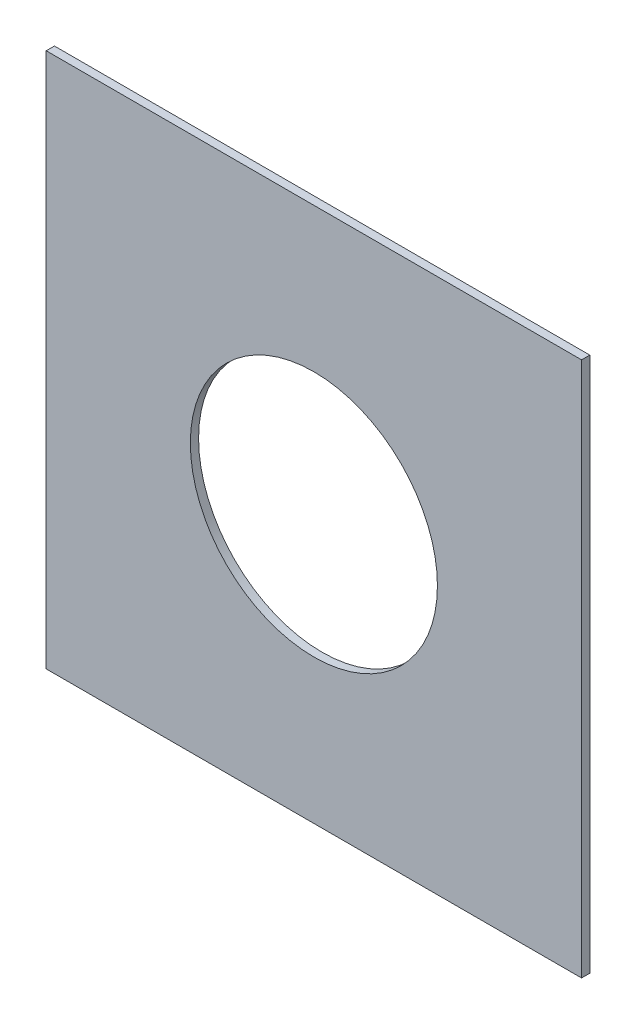
ISO-10303-21;
HEADER;
FILE_DESCRIPTION(('STEP AP214'),'2;1');
FILE_NAME('part.step','',(''),(''),'','','');
FILE_SCHEMA(('AUTOMOTIVE_DESIGN { 1 0 10303 214 1 1 1 1 }'));
ENDSEC;
DATA;
#1=APPLICATION_CONTEXT('core data for automotive mechanical design processes');
#2=APPLICATION_PROTOCOL_DEFINITION('international standard','automotive_design',2000,#1);
#3=PRODUCT_CONTEXT('',#1,'mechanical');
#4=PRODUCT('Part','Part','',(#3));
#5=PRODUCT_RELATED_PRODUCT_CATEGORY('part','',(#4));
#6=PRODUCT_DEFINITION_FORMATION('','',#4);
#7=PRODUCT_DEFINITION_CONTEXT('part definition',#1,'design');
#8=PRODUCT_DEFINITION('design','',#6,#7);
#9=PRODUCT_DEFINITION_SHAPE('','',#8);
#10=(LENGTH_UNIT() NAMED_UNIT(*) SI_UNIT(.MILLI.,.METRE.));
#11=(NAMED_UNIT(*) PLANE_ANGLE_UNIT() SI_UNIT($,.RADIAN.));
#12=(NAMED_UNIT(*) SI_UNIT($,.STERADIAN.) SOLID_ANGLE_UNIT());
#13=UNCERTAINTY_MEASURE_WITH_UNIT(LENGTH_MEASURE(1.E-05),#10,'distance_accuracy_value','');
#14=(GEOMETRIC_REPRESENTATION_CONTEXT(3) GLOBAL_UNCERTAINTY_ASSIGNED_CONTEXT((#13)) GLOBAL_UNIT_ASSIGNED_CONTEXT((#10,
#11,#12)) REPRESENTATION_CONTEXT('',''));
#15=CARTESIAN_POINT('',(0.,0.,0.));
#16=DIRECTION('',(0.,0.,1.));
#17=DIRECTION('',(1.,0.,0.));
#18=AXIS2_PLACEMENT_3D('',#15,#16,#17);
#19=CARTESIAN_POINT('',(-1.876,4.85,-6.999));
#20=DIRECTION('',(0.,1.,0.));
#21=DIRECTION('',(1.,0.,0.));
#22=AXIS2_PLACEMENT_3D('',#19,#20,#21);
#23=PLANE('',#22);
#24=DIRECTION('',(0.,0.,1.));
#25=VECTOR('',#24,1.);
#26=CARTESIAN_POINT('',(-0.575,4.85,-7.01));
#27=LINE('',#26,#25);
#28=CARTESIAN_POINT('',(-0.575,4.85,-7.02));
#29=VERTEX_POINT('',#28);
#30=CARTESIAN_POINT('',(-0.575,4.85,-7.));
#31=VERTEX_POINT('',#30);
#32=EDGE_CURVE('E62',#29,#31,#27,.T.);
#33=ORIENTED_EDGE('',*,*,#32,.F.);
#34=DIRECTION('',(1.,0.,0.));
#35=VECTOR('',#34,1.);
#36=CARTESIAN_POINT('',(-1.225,4.85,-7.02));
#37=LINE('',#36,#35);
#38=CARTESIAN_POINT('',(-1.875,4.85,-7.02));
#39=VERTEX_POINT('',#38);
#40=EDGE_CURVE('E87',#39,#29,#37,.T.);
#41=ORIENTED_EDGE('',*,*,#40,.F.);
#42=DIRECTION('',(0.,0.,-1.));
#43=VECTOR('',#42,1.);
#44=CARTESIAN_POINT('',(-1.875,4.85,-7.01));
#45=LINE('',#44,#43);
#46=CARTESIAN_POINT('',(-1.875,4.85,-7.));
#47=VERTEX_POINT('',#46);
#48=EDGE_CURVE('E73',#47,#39,#45,.T.);
#49=ORIENTED_EDGE('',*,*,#48,.F.);
#50=DIRECTION('',(-1.,0.,0.));
#51=VECTOR('',#50,1.);
#52=CARTESIAN_POINT('',(-1.225,4.85,-7.));
#53=LINE('',#52,#51);
#54=EDGE_CURVE('E56',#31,#47,#53,.T.);
#55=ORIENTED_EDGE('',*,*,#54,.F.);
#56=EDGE_LOOP('',(#33,#41,#49,#55));
#57=FACE_BOUND('',#56,.T.);
#58=ADVANCED_FACE('F17',(#57),#23,.T.);
#59=CARTESIAN_POINT('',(-0.575,4.851,-6.999));
#60=DIRECTION('',(1.,0.,0.));
#61=DIRECTION('',(0.,-1.,0.));
#62=AXIS2_PLACEMENT_3D('',#59,#60,#61);
#63=PLANE('',#62);
#64=DIRECTION('',(0.,0.,-1.));
#65=VECTOR('',#64,1.);
#66=CARTESIAN_POINT('',(-0.575,3.55,-7.01));
#67=LINE('',#66,#65);
#68=CARTESIAN_POINT('',(-0.575,3.55,-7.));
#69=VERTEX_POINT('',#68);
#70=CARTESIAN_POINT('',(-0.575,3.55,-7.02));
#71=VERTEX_POINT('',#70);
#72=EDGE_CURVE('E71',#69,#71,#67,.T.);
#73=ORIENTED_EDGE('',*,*,#72,.T.);
#74=DIRECTION('',(0.,-1.,0.));
#75=VECTOR('',#74,1.);
#76=CARTESIAN_POINT('',(-0.575,4.2,-7.02));
#77=LINE('',#76,#75);
#78=EDGE_CURVE('E67',#29,#71,#77,.T.);
#79=ORIENTED_EDGE('',*,*,#78,.F.);
#80=ORIENTED_EDGE('',*,*,#32,.T.);
#81=DIRECTION('',(0.,1.,0.));
#82=VECTOR('',#81,1.);
#83=CARTESIAN_POINT('',(-0.575,4.2,-7.));
#84=LINE('',#83,#82);
#85=EDGE_CURVE('E64',#69,#31,#84,.T.);
#86=ORIENTED_EDGE('',*,*,#85,.F.);
#87=EDGE_LOOP('',(#73,#79,#80,#86));
#88=FACE_BOUND('',#87,.T.);
#89=ADVANCED_FACE('F63',(#88),#63,.T.);
#90=CARTESIAN_POINT('',(-1.225,4.2,-7.));
#91=DIRECTION('',(0.,0.,-1.));
#92=DIRECTION('',(-1.,0.,0.));
#93=AXIS2_PLACEMENT_3D('',#90,#91,#92);
#94=CYLINDRICAL_SURFACE('',#93,0.3);
#95=CARTESIAN_POINT('',(-1.225,4.2,-7.02));
#96=DIRECTION('',(0.,0.,-1.));
#97=DIRECTION('',(-1.,0.,0.));
#98=AXIS2_PLACEMENT_3D('',#95,#96,#97);
#99=CIRCLE('',#98,0.3);
#100=CARTESIAN_POINT('',(-1.525,4.2,-7.02));
#101=VERTEX_POINT('',#100);
#102=EDGE_CURVE('E82',#101,#101,#99,.F.);
#103=ORIENTED_EDGE('',*,*,#102,.F.);
#104=EDGE_LOOP('',(#103));
#105=FACE_BOUND('',#104,.T.);
#106=CARTESIAN_POINT('',(-1.225,4.2,-7.));
#107=DIRECTION('',(0.,0.,-1.));
#108=DIRECTION('',(-1.,0.,0.));
#109=AXIS2_PLACEMENT_3D('',#106,#107,#108);
#110=CIRCLE('',#109,0.3);
#111=CARTESIAN_POINT('',(-1.525,4.2,-7.));
#112=VERTEX_POINT('',#111);
#113=EDGE_CURVE('E21',#112,#112,#110,.T.);
#114=ORIENTED_EDGE('',*,*,#113,.F.);
#115=EDGE_LOOP('',(#114));
#116=FACE_BOUND('',#115,.T.);
#117=ADVANCED_FACE('F99',(#105,#116),#94,.F.);
#118=CARTESIAN_POINT('',(-0.574,4.851,-7.));
#119=DIRECTION('',(0.,0.,1.));
#120=DIRECTION('',(-1.,0.,0.));
#121=AXIS2_PLACEMENT_3D('',#118,#119,#120);
#122=PLANE('',#121);
#123=ORIENTED_EDGE('',*,*,#113,.T.);
#124=EDGE_LOOP('',(#123));
#125=FACE_BOUND('',#124,.T.);
#126=DIRECTION('',(0.,1.,0.));
#127=VECTOR('',#126,1.);
#128=CARTESIAN_POINT('',(-1.875,4.2,-7.));
#129=LINE('',#128,#127);
#130=CARTESIAN_POINT('',(-1.875,3.55,-7.));
#131=VERTEX_POINT('',#130);
#132=EDGE_CURVE('E94',#131,#47,#129,.T.);
#133=ORIENTED_EDGE('',*,*,#132,.F.);
#134=DIRECTION('',(-1.,0.,0.));
#135=VECTOR('',#134,1.);
#136=CARTESIAN_POINT('',(-1.225,3.55,-7.));
#137=LINE('',#136,#135);
#138=EDGE_CURVE('E78',#69,#131,#137,.T.);
#139=ORIENTED_EDGE('',*,*,#138,.F.);
#140=ORIENTED_EDGE('',*,*,#85,.T.);
#141=ORIENTED_EDGE('',*,*,#54,.T.);
#142=EDGE_LOOP('',(#133,#139,#140,#141));
#143=FACE_BOUND('',#142,.T.);
#144=ADVANCED_FACE('F76',(#125,#143),#122,.T.);
#145=CARTESIAN_POINT('',(-1.875,3.549,-6.999));
#146=DIRECTION('',(-1.,0.,0.));
#147=DIRECTION('',(0.,1.,0.));
#148=AXIS2_PLACEMENT_3D('',#145,#146,#147);
#149=PLANE('',#148);
#150=ORIENTED_EDGE('',*,*,#48,.T.);
#151=DIRECTION('',(0.,1.,0.));
#152=VECTOR('',#151,1.);
#153=CARTESIAN_POINT('',(-1.875,4.2,-7.02));
#154=LINE('',#153,#152);
#155=CARTESIAN_POINT('',(-1.875,3.55,-7.02));
#156=VERTEX_POINT('',#155);
#157=EDGE_CURVE('E36',#156,#39,#154,.T.);
#158=ORIENTED_EDGE('',*,*,#157,.F.);
#159=DIRECTION('',(0.,0.,-1.));
#160=VECTOR('',#159,1.);
#161=CARTESIAN_POINT('',(-1.875,3.55,-7.01));
#162=LINE('',#161,#160);
#163=EDGE_CURVE('E27',#131,#156,#162,.T.);
#164=ORIENTED_EDGE('',*,*,#163,.F.);
#165=ORIENTED_EDGE('',*,*,#132,.T.);
#166=EDGE_LOOP('',(#150,#158,#164,#165));
#167=FACE_BOUND('',#166,.T.);
#168=ADVANCED_FACE('F108',(#167),#149,.T.);
#169=CARTESIAN_POINT('',(-1.876,4.851,-7.02));
#170=DIRECTION('',(0.,0.,-1.));
#171=DIRECTION('',(1.,0.,0.));
#172=AXIS2_PLACEMENT_3D('',#169,#170,#171);
#173=PLANE('',#172);
#174=ORIENTED_EDGE('',*,*,#102,.T.);
#175=EDGE_LOOP('',(#174));
#176=FACE_BOUND('',#175,.T.);
#177=ORIENTED_EDGE('',*,*,#40,.T.);
#178=ORIENTED_EDGE('',*,*,#78,.T.);
#179=DIRECTION('',(1.,0.,0.));
#180=VECTOR('',#179,1.);
#181=CARTESIAN_POINT('',(-1.225,3.55,-7.02));
#182=LINE('',#181,#180);
#183=EDGE_CURVE('E11',#156,#71,#182,.T.);
#184=ORIENTED_EDGE('',*,*,#183,.F.);
#185=ORIENTED_EDGE('',*,*,#157,.T.);
#186=EDGE_LOOP('',(#177,#178,#184,#185));
#187=FACE_BOUND('',#186,.T.);
#188=ADVANCED_FACE('F112',(#176,#187),#173,.T.);
#189=CARTESIAN_POINT('',(-0.574,3.55,-6.999));
#190=DIRECTION('',(0.,-1.,0.));
#191=DIRECTION('',(-1.,0.,0.));
#192=AXIS2_PLACEMENT_3D('',#189,#190,#191);
#193=PLANE('',#192);
#194=ORIENTED_EDGE('',*,*,#163,.T.);
#195=ORIENTED_EDGE('',*,*,#183,.T.);
#196=ORIENTED_EDGE('',*,*,#72,.F.);
#197=ORIENTED_EDGE('',*,*,#138,.T.);
#198=EDGE_LOOP('',(#194,#195,#196,#197));
#199=FACE_BOUND('',#198,.T.);
#200=ADVANCED_FACE('F19',(#199),#193,.T.);
#201=CLOSED_SHELL('',(#58,#89,#117,#144,#168,#188,#200));
#202=MANIFOLD_SOLID_BREP('B1',#201);
#203=ADVANCED_BREP_SHAPE_REPRESENTATION('',(#18,#202),#14);
#204=SHAPE_DEFINITION_REPRESENTATION(#9,#203);
ENDSEC;
END-ISO-10303-21;
